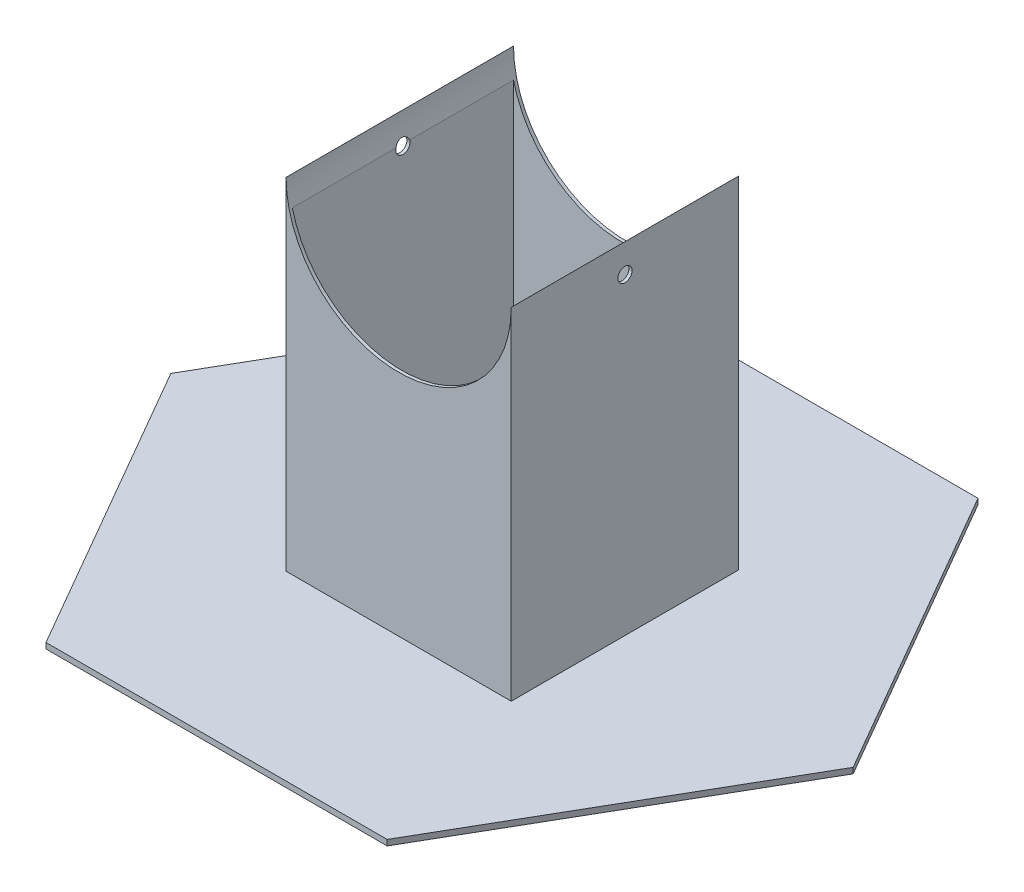
ISO-10303-21;
HEADER;
FILE_DESCRIPTION(('STEP AP214'),'2;1');
FILE_NAME('part.step','',(''),(''),'','','');
FILE_SCHEMA(('AUTOMOTIVE_DESIGN { 1 0 10303 214 1 1 1 1 }'));
ENDSEC;
DATA;
#1=APPLICATION_CONTEXT('core data for automotive mechanical design processes');
#2=APPLICATION_PROTOCOL_DEFINITION('international standard','automotive_design',2000,#1);
#3=PRODUCT_CONTEXT('',#1,'mechanical');
#4=PRODUCT('Part','Part','',(#3));
#5=PRODUCT_RELATED_PRODUCT_CATEGORY('part','',(#4));
#6=PRODUCT_DEFINITION_FORMATION('','',#4);
#7=PRODUCT_DEFINITION_CONTEXT('part definition',#1,'design');
#8=PRODUCT_DEFINITION('design','',#6,#7);
#9=PRODUCT_DEFINITION_SHAPE('','',#8);
#10=(LENGTH_UNIT() NAMED_UNIT(*) SI_UNIT(.MILLI.,.METRE.));
#11=(NAMED_UNIT(*) PLANE_ANGLE_UNIT() SI_UNIT($,.RADIAN.));
#12=(NAMED_UNIT(*) SI_UNIT($,.STERADIAN.) SOLID_ANGLE_UNIT());
#13=UNCERTAINTY_MEASURE_WITH_UNIT(LENGTH_MEASURE(1.E-05),#10,'distance_accuracy_value','');
#14=(GEOMETRIC_REPRESENTATION_CONTEXT(3) GLOBAL_UNCERTAINTY_ASSIGNED_CONTEXT((#13)) GLOBAL_UNIT_ASSIGNED_CONTEXT((#10,
#11,#12)) REPRESENTATION_CONTEXT('',''));
#15=CARTESIAN_POINT('',(0.,0.,0.));
#16=DIRECTION('',(0.,0.,1.));
#17=DIRECTION('',(1.,0.,0.));
#18=AXIS2_PLACEMENT_3D('',#15,#16,#17);
#19=CARTESIAN_POINT('',(-50.292,154.94,-50.8));
#20=DIRECTION('',(0.,0.,1.));
#21=DIRECTION('',(1.,0.,0.));
#22=AXIS2_PLACEMENT_3D('',#19,#20,#21);
#23=PLANE('',#22);
#24=CARTESIAN_POINT('',(0.,154.94,-50.8));
#25=DIRECTION('',(0.,0.,1.));
#26=DIRECTION('',(1.,0.,0.));
#27=AXIS2_PLACEMENT_3D('',#24,#25,#26);
#28=CIRCLE('',#27,50.292);
#29=CARTESIAN_POINT('',(50.292,154.94,-50.8));
#30=VERTEX_POINT('',#29);
#31=CARTESIAN_POINT('',(-50.292,154.94,-50.8));
#32=VERTEX_POINT('',#31);
#33=EDGE_CURVE('E170',#30,#32,#28,.F.);
#34=ORIENTED_EDGE('',*,*,#33,.F.);
#35=DIRECTION('',(0.,-1.,0.));
#36=VECTOR('',#35,1.);
#37=CARTESIAN_POINT('',(50.292,154.94,-50.8));
#38=LINE('',#37,#36);
#39=CARTESIAN_POINT('',(50.292,2.54,-50.8));
#40=VERTEX_POINT('',#39);
#41=EDGE_CURVE('E156',#30,#40,#38,.T.);
#42=ORIENTED_EDGE('',*,*,#41,.T.);
#43=DIRECTION('',(-1.,0.,0.));
#44=VECTOR('',#43,1.);
#45=CARTESIAN_POINT('',(-50.292,2.54,-50.8));
#46=LINE('',#45,#44);
#47=CARTESIAN_POINT('',(-50.292,2.54,-50.8));
#48=VERTEX_POINT('',#47);
#49=EDGE_CURVE('E192',#40,#48,#46,.T.);
#50=ORIENTED_EDGE('',*,*,#49,.T.);
#51=DIRECTION('',(0.,-1.,0.));
#52=VECTOR('',#51,1.);
#53=CARTESIAN_POINT('',(-50.292,154.94,-50.8));
#54=LINE('',#53,#52);
#55=EDGE_CURVE('E167',#32,#48,#54,.T.);
#56=ORIENTED_EDGE('',*,*,#55,.F.);
#57=EDGE_LOOP('',(#34,#42,#50,#56));
#58=FACE_BOUND('',#57,.T.);
#59=ADVANCED_FACE('F33',(#58),#23,.F.);
#60=CARTESIAN_POINT('',(-50.292,154.94,50.8));
#61=DIRECTION('',(0.,0.,-1.));
#62=DIRECTION('',(-1.,0.,0.));
#63=AXIS2_PLACEMENT_3D('',#60,#61,#62);
#64=PLANE('',#63);
#65=CARTESIAN_POINT('',(0.,154.94,50.8));
#66=DIRECTION('',(0.,0.,-1.));
#67=DIRECTION('',(-1.,0.,0.));
#68=AXIS2_PLACEMENT_3D('',#65,#66,#67);
#69=CIRCLE('',#68,50.292);
#70=CARTESIAN_POINT('',(-50.292,154.94,50.8));
#71=VERTEX_POINT('',#70);
#72=CARTESIAN_POINT('',(50.292,154.94,50.8));
#73=VERTEX_POINT('',#72);
#74=EDGE_CURVE('E176',#71,#73,#69,.F.);
#75=ORIENTED_EDGE('',*,*,#74,.F.);
#76=DIRECTION('',(0.,-1.,0.));
#77=VECTOR('',#76,1.);
#78=CARTESIAN_POINT('',(-50.292,154.94,50.8));
#79=LINE('',#78,#77);
#80=CARTESIAN_POINT('',(-50.292,2.54,50.8));
#81=VERTEX_POINT('',#80);
#82=EDGE_CURVE('E197',#71,#81,#79,.T.);
#83=ORIENTED_EDGE('',*,*,#82,.T.);
#84=DIRECTION('',(1.,0.,0.));
#85=VECTOR('',#84,1.);
#86=CARTESIAN_POINT('',(-50.292,2.54,50.8));
#87=LINE('',#86,#85);
#88=CARTESIAN_POINT('',(50.292,2.54,50.8));
#89=VERTEX_POINT('',#88);
#90=EDGE_CURVE('E180',#81,#89,#87,.T.);
#91=ORIENTED_EDGE('',*,*,#90,.T.);
#92=DIRECTION('',(0.,-1.,0.));
#93=VECTOR('',#92,1.);
#94=CARTESIAN_POINT('',(50.292,154.94,50.8));
#95=LINE('',#94,#93);
#96=EDGE_CURVE('E182',#73,#89,#95,.T.);
#97=ORIENTED_EDGE('',*,*,#96,.F.);
#98=EDGE_LOOP('',(#75,#83,#91,#97));
#99=FACE_BOUND('',#98,.T.);
#100=ADVANCED_FACE('F316',(#99),#64,.F.);
#101=CARTESIAN_POINT('',(48.89754,-35.56,-49.40554));
#102=DIRECTION('',(1.,0.,0.));
#103=DIRECTION('',(0.,0.,-1.));
#104=AXIS2_PLACEMENT_3D('',#101,#102,#103);
#105=PLANE('',#104);
#106=DIRECTION('',(0.,0.,1.));
#107=VECTOR('',#106,1.);
#108=CARTESIAN_POINT('',(48.8975399999999,143.179224262473,-819.223906750812));
#109=LINE('',#108,#107);
#110=CARTESIAN_POINT('',(48.89754,143.179224262473,-49.40554));
#111=VERTEX_POINT('',#110);
#112=CARTESIAN_POINT('',(48.89754,143.179224262473,-3.03290006178622));
#113=VERTEX_POINT('',#112);
#114=EDGE_CURVE('E296',#111,#113,#109,.T.);
#115=ORIENTED_EDGE('',*,*,#114,.F.);
#116=DIRECTION('',(0.,1.,0.));
#117=VECTOR('',#116,1.);
#118=CARTESIAN_POINT('',(48.89754,-35.56,-49.40554));
#119=LINE('',#118,#117);
#120=CARTESIAN_POINT('',(48.89754,0.,-49.40554));
#121=VERTEX_POINT('',#120);
#122=EDGE_CURVE('E256',#121,#111,#119,.T.);
#123=ORIENTED_EDGE('',*,*,#122,.F.);
#124=DIRECTION('',(0.,0.,-1.));
#125=VECTOR('',#124,1.);
#126=CARTESIAN_POINT('',(48.89754,0.,0.));
#127=LINE('',#126,#125);
#128=CARTESIAN_POINT('',(48.89754,0.,49.40554));
#129=VERTEX_POINT('',#128);
#130=EDGE_CURVE('E188',#129,#121,#127,.T.);
#131=ORIENTED_EDGE('',*,*,#130,.F.);
#132=DIRECTION('',(0.,1.,0.));
#133=VECTOR('',#132,1.);
#134=CARTESIAN_POINT('',(48.89754,-35.56,49.40554));
#135=LINE('',#134,#133);
#136=CARTESIAN_POINT('',(48.89754,143.179224262473,49.40554));
#137=VERTEX_POINT('',#136);
#138=EDGE_CURVE('E257',#129,#137,#135,.T.);
#139=ORIENTED_EDGE('',*,*,#138,.T.);
#140=CARTESIAN_POINT('',(48.89754,143.179224262472,3.03290006178626));
#141=VERTEX_POINT('',#140);
#142=EDGE_CURVE('E382',#141,#137,#109,.T.);
#143=ORIENTED_EDGE('',*,*,#142,.F.);
#144=CARTESIAN_POINT('',(48.89754,142.24,0.));
#145=DIRECTION('',(1.,0.,0.));
#146=DIRECTION('',(0.,0.,-1.));
#147=AXIS2_PLACEMENT_3D('',#144,#145,#146);
#148=CIRCLE('',#147,3.175);
#149=EDGE_CURVE('E243',#141,#113,#148,.T.);
#150=ORIENTED_EDGE('',*,*,#149,.T.);
#151=EDGE_LOOP('',(#115,#123,#131,#139,#143,#150));
#152=FACE_BOUND('',#151,.T.);
#153=ADVANCED_FACE('F279',(#152),#105,.F.);
#154=CARTESIAN_POINT('',(-48.89754,-35.56,49.40554));
#155=DIRECTION('',(0.,0.,1.));
#156=DIRECTION('',(1.,0.,0.));
#157=AXIS2_PLACEMENT_3D('',#154,#155,#156);
#158=PLANE('',#157);
#159=CARTESIAN_POINT('',(0.,154.94,49.40554));
#160=DIRECTION('',(0.,0.,1.));
#161=DIRECTION('',(1.,0.,0.));
#162=AXIS2_PLACEMENT_3D('',#159,#160,#161);
#163=CIRCLE('',#162,50.292);
#164=CARTESIAN_POINT('',(-48.89754,143.179224262474,49.40554));
#165=VERTEX_POINT('',#164);
#166=EDGE_CURVE('E54',#137,#165,#163,.F.);
#167=ORIENTED_EDGE('',*,*,#166,.F.);
#168=ORIENTED_EDGE('',*,*,#138,.F.);
#169=DIRECTION('',(1.,0.,0.));
#170=VECTOR('',#169,1.);
#171=CARTESIAN_POINT('',(0.,0.,49.40554));
#172=LINE('',#171,#170);
#173=CARTESIAN_POINT('',(-48.89754,0.,49.40554));
#174=VERTEX_POINT('',#173);
#175=EDGE_CURVE('E271',#174,#129,#172,.T.);
#176=ORIENTED_EDGE('',*,*,#175,.F.);
#177=DIRECTION('',(0.,1.,0.));
#178=VECTOR('',#177,1.);
#179=CARTESIAN_POINT('',(-48.89754,-35.56,49.40554));
#180=LINE('',#179,#178);
#181=EDGE_CURVE('E260',#174,#165,#180,.T.);
#182=ORIENTED_EDGE('',*,*,#181,.T.);
#183=EDGE_LOOP('',(#167,#168,#176,#182));
#184=FACE_BOUND('',#183,.T.);
#185=ADVANCED_FACE('F282',(#184),#158,.F.);
#186=CARTESIAN_POINT('',(-48.89754,-35.56,-49.40554));
#187=DIRECTION('',(-1.,0.,0.));
#188=DIRECTION('',(0.,0.,1.));
#189=AXIS2_PLACEMENT_3D('',#186,#187,#188);
#190=PLANE('',#189);
#191=DIRECTION('',(0.,0.,1.));
#192=VECTOR('',#191,1.);
#193=CARTESIAN_POINT('',(-48.8975400000001,143.179224262474,-819.223906750812));
#194=LINE('',#193,#192);
#195=CARTESIAN_POINT('',(-48.89754,143.179224262474,3.0329000617859));
#196=VERTEX_POINT('',#195);
#197=EDGE_CURVE('E62',#165,#196,#194,.F.);
#198=ORIENTED_EDGE('',*,*,#197,.F.);
#199=ORIENTED_EDGE('',*,*,#181,.F.);
#200=DIRECTION('',(0.,0.,1.));
#201=VECTOR('',#200,1.);
#202=CARTESIAN_POINT('',(-48.89754,0.,0.));
#203=LINE('',#202,#201);
#204=CARTESIAN_POINT('',(-48.89754,0.,-49.40554));
#205=VERTEX_POINT('',#204);
#206=EDGE_CURVE('E269',#205,#174,#203,.T.);
#207=ORIENTED_EDGE('',*,*,#206,.F.);
#208=DIRECTION('',(0.,1.,0.));
#209=VECTOR('',#208,1.);
#210=CARTESIAN_POINT('',(-48.89754,-35.56,-49.40554));
#211=LINE('',#210,#209);
#212=CARTESIAN_POINT('',(-48.89754,143.179224262473,-49.40554));
#213=VERTEX_POINT('',#212);
#214=EDGE_CURVE('E262',#205,#213,#211,.T.);
#215=ORIENTED_EDGE('',*,*,#214,.T.);
#216=CARTESIAN_POINT('',(-48.89754,143.179224262474,-3.03290006178589));
#217=VERTEX_POINT('',#216);
#218=EDGE_CURVE('E286',#217,#213,#194,.F.);
#219=ORIENTED_EDGE('',*,*,#218,.F.);
#220=CARTESIAN_POINT('',(-48.89754,142.24,0.));
#221=DIRECTION('',(-1.,0.,0.));
#222=DIRECTION('',(0.,0.,1.));
#223=AXIS2_PLACEMENT_3D('',#220,#221,#222);
#224=CIRCLE('',#223,3.175);
#225=EDGE_CURVE('E242',#217,#196,#224,.T.);
#226=ORIENTED_EDGE('',*,*,#225,.T.);
#227=EDGE_LOOP('',(#198,#199,#207,#215,#219,#226));
#228=FACE_BOUND('',#227,.T.);
#229=ADVANCED_FACE('F284',(#228),#190,.F.);
#230=CARTESIAN_POINT('',(-48.89754,-35.56,-49.40554));
#231=DIRECTION('',(0.,0.,-1.));
#232=DIRECTION('',(-1.,0.,0.));
#233=AXIS2_PLACEMENT_3D('',#230,#231,#232);
#234=PLANE('',#233);
#235=CARTESIAN_POINT('',(0.,154.94,-49.40554));
#236=DIRECTION('',(0.,0.,-1.));
#237=DIRECTION('',(-1.,0.,0.));
#238=AXIS2_PLACEMENT_3D('',#235,#236,#237);
#239=CIRCLE('',#238,50.292);
#240=EDGE_CURVE('E292',#213,#111,#239,.F.);
#241=ORIENTED_EDGE('',*,*,#240,.F.);
#242=ORIENTED_EDGE('',*,*,#214,.F.);
#243=DIRECTION('',(-1.,0.,0.));
#244=VECTOR('',#243,1.);
#245=CARTESIAN_POINT('',(0.,0.,-49.40554));
#246=LINE('',#245,#244);
#247=EDGE_CURVE('E259',#121,#205,#246,.T.);
#248=ORIENTED_EDGE('',*,*,#247,.F.);
#249=ORIENTED_EDGE('',*,*,#122,.T.);
#250=EDGE_LOOP('',(#241,#242,#248,#249));
#251=FACE_BOUND('',#250,.T.);
#252=ADVANCED_FACE('F379',(#251),#234,.F.);
#253=CARTESIAN_POINT('',(-152.564506729179,142.24,0.));
#254=DIRECTION('',(1.,0.,0.));
#255=DIRECTION('',(0.,0.,-1.));
#256=AXIS2_PLACEMENT_3D('',#253,#254,#255);
#257=CYLINDRICAL_SURFACE('',#256,3.175);
#258=CARTESIAN_POINT('',(-50.292,142.24,0.));
#259=DIRECTION('',(1.,0.,0.));
#260=DIRECTION('',(0.,0.,-1.));
#261=AXIS2_PLACEMENT_3D('',#258,#259,#260);
#262=CIRCLE('',#261,3.175);
#263=CARTESIAN_POINT('',(-50.292,142.24,-3.17499999999999));
#264=VERTEX_POINT('',#263);
#265=EDGE_CURVE('E246',#264,#264,#262,.T.);
#266=ORIENTED_EDGE('',*,*,#265,.F.);
#267=EDGE_LOOP('',(#266));
#268=FACE_BOUND('',#267,.T.);
#269=CARTESIAN_POINT('',(-48.89754,143.179224262474,3.03290006178584));
#270=CARTESIAN_POINT('',(-48.9179893992919,143.264238182814,3.0065815960853));
#271=CARTESIAN_POINT('',(-48.9379584637581,143.348246330188,2.9766403521669));
#272=CARTESIAN_POINT('',(-48.9768439050836,143.513662240138,2.90970074910981));
#273=CARTESIAN_POINT('',(-48.9957601920708,143.595069780457,2.87270178866806));
#274=CARTESIAN_POINT('',(-49.032448705651,143.754699055396,2.79183056879005));
#275=CARTESIAN_POINT('',(-49.0502206715994,143.832920062732,2.74795675121051));
#276=CARTESIAN_POINT('',(-49.0845313527572,143.985540981022,2.65363355703935));
#277=CARTESIAN_POINT('',(-49.1010701273031,144.05994107577,2.60318449714461));
#278=CARTESIAN_POINT('',(-49.1487688204472,144.276716257841,2.44228156961581));
#279=CARTESIAN_POINT('',(-49.178001932995,144.412626060457,2.32229228755659));
#280=CARTESIAN_POINT('',(-49.2308129604337,144.662417626851,2.06040933073773));
#281=CARTESIAN_POINT('',(-49.2543939929555,144.776311527639,1.91852780284665));
#282=CARTESIAN_POINT('',(-49.2953215101621,144.976725640279,1.61949285058442));
#283=CARTESIAN_POINT('',(-49.3127718774093,145.063698655853,1.46265764861859));
#284=CARTESIAN_POINT('',(-49.3418817835325,145.210170490173,1.13610750424401));
#285=CARTESIAN_POINT('',(-49.3535404915441,145.269665366853,0.966390717882516));
#286=CARTESIAN_POINT('',(-49.3708615193963,145.358490470322,0.621906555241024));
#287=CARTESIAN_POINT('',(-49.3766183634835,145.38829597427,0.447266370948575));
#288=CARTESIAN_POINT('',(-49.3824469421016,145.418474723158,0.0953868734003471));
#289=CARTESIAN_POINT('',(-49.3825194876369,145.418852166733,-0.0818520654703455));
#290=CARTESIAN_POINT('',(-49.3770001443873,145.390271130975,-0.432637670156184));
#291=CARTESIAN_POINT('',(-49.3714467867848,145.361512203313,-0.606201251606211));
#292=CARTESIAN_POINT('',(-49.3547528518855,145.275864249661,-0.945963435641689));
#293=CARTESIAN_POINT('',(-49.3436121310815,145.218974501151,-1.11216184893894));
#294=CARTESIAN_POINT('',(-49.3157743873761,145.07872461969,-1.43280908044553));
#295=CARTESIAN_POINT('',(-49.2990681335541,144.995320520966,-1.5872378512946));
#296=CARTESIAN_POINT('',(-49.2602195496805,144.80464294086,-1.87981980105898));
#297=CARTESIAN_POINT('',(-49.2380768438732,144.697367809612,-2.01797185398607));
#298=CARTESIAN_POINT('',(-49.1883126621696,144.46097912215,-2.27569483454521));
#299=CARTESIAN_POINT('',(-49.1606358153229,144.331646975927,-2.39505420679704));
#300=CARTESIAN_POINT('',(-49.1003044498272,144.055827010561,-2.61035757164311));
#301=CARTESIAN_POINT('',(-49.0676519130346,143.909346027294,-2.70631084766806));
#302=CARTESIAN_POINT('',(-49.0117483963388,143.6642398046,-2.83958274073972));
#303=CARTESIAN_POINT('',(-48.9898957075442,143.569637844502,-2.88507275872232));
#304=CARTESIAN_POINT('',(-48.9447625290135,143.376898135769,-2.9663117179059));
#305=CARTESIAN_POINT('',(-48.9214849727467,143.278767812468,-3.00207989908564));
#306=CARTESIAN_POINT('',(-48.8975400000002,143.179224262474,-3.03290006178582));
#307=B_SPLINE_CURVE_WITH_KNOTS('',3,(#269,#270,#271,#272,#273,#274,#275,#276,#277,#278,#279,
#280,#281,#282,#283,#284,#285,#286,#287,#288,#289,#290,#291,#292,#293,#294,#295,#296,#297,#298,
#299,#300,#301,#302,#303,#304,#305,#306),.UNSPECIFIED.,.F.,.F.,(4,2,2,2,2,2,2,2,2,2,2,2,2,2,2,2,
2,2,4),(0.,0.273862412887594,0.547748168724408,0.821696089075695,1.09563081958494,
1.64363640597205,2.19133901873811,2.72925403482774,3.26724619727868,3.79648051276399,
4.32563931987136,4.85119831631432,5.37677081204049,5.90321939176572,6.42970436871027,
6.96174738289733,7.49357903143091,7.81477732175509,8.13533523872828),.UNSPECIFIED.);
#308=EDGE_CURVE('E293',#196,#217,#307,.T.);
#309=ORIENTED_EDGE('',*,*,#308,.F.);
#310=ORIENTED_EDGE('',*,*,#225,.F.);
#311=EDGE_LOOP('',(#309,#310));
#312=FACE_BOUND('',#311,.T.);
#313=ADVANCED_FACE('F303',(#268,#312),#257,.F.);
#314=CARTESIAN_POINT('',(50.292,142.24,0.));
#315=DIRECTION('',(1.,0.,0.));
#316=DIRECTION('',(0.,0.,-1.));
#317=AXIS2_PLACEMENT_3D('',#314,#315,#316);
#318=CIRCLE('',#317,3.175);
#319=CARTESIAN_POINT('',(50.292,142.24,-3.17500000000001));
#320=VERTEX_POINT('',#319);
#321=EDGE_CURVE('E175',#320,#320,#318,.T.);
#322=ORIENTED_EDGE('',*,*,#321,.T.);
#323=EDGE_LOOP('',(#322));
#324=FACE_BOUND('',#323,.T.);
#325=CARTESIAN_POINT('',(48.89754,143.179224262472,-3.03290006178628));
#326=CARTESIAN_POINT('',(48.9179893992916,143.264238182812,-3.00658159608577));
#327=CARTESIAN_POINT('',(48.9379584637578,143.348246330187,-2.9766403521674));
#328=CARTESIAN_POINT('',(48.9768439050832,143.513662240137,-2.90970074911038));
#329=CARTESIAN_POINT('',(48.9957601920704,143.595069780456,-2.87270178866867));
#330=CARTESIAN_POINT('',(49.0324487056507,143.754699055395,-2.79183056879074));
#331=CARTESIAN_POINT('',(49.0502206715991,143.832920062731,-2.74795675121123));
#332=CARTESIAN_POINT('',(49.0845313527569,143.985540981021,-2.65363355704014));
#333=CARTESIAN_POINT('',(49.1010701273028,144.059941075768,-2.60318449714544));
#334=CARTESIAN_POINT('',(49.148768820447,144.27671625784,-2.44228156961675));
#335=CARTESIAN_POINT('',(49.1780019329947,144.412626060456,-2.3222922875576));
#336=CARTESIAN_POINT('',(49.2308129604335,144.66241762685,-2.06040933073886));
#337=CARTESIAN_POINT('',(49.2543939929553,144.776311527638,-1.91852780284784));
#338=CARTESIAN_POINT('',(49.2953215101619,144.976725640278,-1.6194928505857));
#339=CARTESIAN_POINT('',(49.3127718774092,145.063698655852,-1.46265764861991));
#340=CARTESIAN_POINT('',(49.3418817835324,145.210170490172,-1.13610750424538));
#341=CARTESIAN_POINT('',(49.353540491544,145.269665366853,-0.966390717883905));
#342=CARTESIAN_POINT('',(49.3708615193962,145.358490470322,-0.621906555242443));
#343=CARTESIAN_POINT('',(49.3766183634834,145.38829597427,-0.44726637095001));
#344=CARTESIAN_POINT('',(49.3824469421016,145.418474723158,-0.0953868734017954));
#345=CARTESIAN_POINT('',(49.3825194876369,145.418852166733,0.0818520654688988));
#346=CARTESIAN_POINT('',(49.3770001443873,145.390271130975,0.432637670154756));
#347=CARTESIAN_POINT('',(49.3714467867848,145.361512203314,0.6062012516048));
#348=CARTESIAN_POINT('',(49.3547528518856,145.275864249662,0.945963435640323));
#349=CARTESIAN_POINT('',(49.3436121310816,145.218974501152,1.1121618489376));
#350=CARTESIAN_POINT('',(49.3157743873762,145.078724619691,1.43280908044426));
#351=CARTESIAN_POINT('',(49.2990681335542,144.995320520967,1.58723785129336));
#352=CARTESIAN_POINT('',(49.2602195496806,144.804642940861,1.87981980105782));
#353=CARTESIAN_POINT('',(49.2380768438734,144.697367809613,2.01797185398497));
#354=CARTESIAN_POINT('',(49.1883126621698,144.460979122151,2.2756948345442));
#355=CARTESIAN_POINT('',(49.1606358153231,144.331646975928,2.39505420679608));
#356=CARTESIAN_POINT('',(49.1003044498274,144.055827010562,2.61035757164226));
#357=CARTESIAN_POINT('',(49.0676519130349,143.909346027295,2.70631084766729));
#358=CARTESIAN_POINT('',(49.011748396339,143.664239804601,2.8395827407393));
#359=CARTESIAN_POINT('',(48.9898957075442,143.569637844503,2.88507275872214));
#360=CARTESIAN_POINT('',(48.9447625290134,143.376898135769,2.96631171790609));
#361=CARTESIAN_POINT('',(48.9214849727464,143.278767812467,3.00207989908597));
#362=CARTESIAN_POINT('',(48.8975399999998,143.179224262472,3.03290006178625));
#363=B_SPLINE_CURVE_WITH_KNOTS('',3,(#325,#326,#327,#328,#329,#330,#331,#332,#333,#334,#335,
#336,#337,#338,#339,#340,#341,#342,#343,#344,#345,#346,#347,#348,#349,#350,#351,#352,#353,#354,
#355,#356,#357,#358,#359,#360,#361,#362),.UNSPECIFIED.,.F.,.F.,(4,2,2,2,2,2,2,2,2,2,2,2,2,2,2,2,
2,2,4),(0.,0.273862412887628,0.547748168724424,0.82169608907571,1.09563081958495,
1.64363640597202,2.19133901873808,2.72925403482773,3.26724619727871,3.79648051276402,
4.3256393198714,4.85119831631436,5.37677081204053,5.90321939176577,6.42970436871031,
6.96174738289734,7.49357903143091,7.81477732175656,8.13533523873125),.UNSPECIFIED.);
#364=EDGE_CURVE('E11',#113,#141,#363,.T.);
#365=ORIENTED_EDGE('',*,*,#364,.F.);
#366=ORIENTED_EDGE('',*,*,#149,.F.);
#367=EDGE_LOOP('',(#365,#366));
#368=FACE_BOUND('',#367,.T.);
#369=ADVANCED_FACE('F354',(#324,#368),#257,.F.);
#370=CARTESIAN_POINT('',(-76.3645067291794,2.54,131.982271536748));
#371=DIRECTION('',(0.,0.,-1.));
#372=DIRECTION('',(-1.,0.,0.));
#373=AXIS2_PLACEMENT_3D('',#370,#371,#372);
#374=PLANE('',#373);
#375=DIRECTION('',(1.,0.,0.));
#376=VECTOR('',#375,1.);
#377=CARTESIAN_POINT('',(-76.3645067291794,0.,131.982271536748));
#378=LINE('',#377,#376);
#379=CARTESIAN_POINT('',(-76.3645067291794,0.,131.982271536748));
#380=VERTEX_POINT('',#379);
#381=CARTESIAN_POINT('',(76.0354932708207,0.,131.982271536748));
#382=VERTEX_POINT('',#381);
#383=EDGE_CURVE('E166',#380,#382,#378,.T.);
#384=ORIENTED_EDGE('',*,*,#383,.T.);
#385=DIRECTION('',(0.,-1.,0.));
#386=VECTOR('',#385,1.);
#387=CARTESIAN_POINT('',(76.0354932708207,2.54,131.982271536748));
#388=LINE('',#387,#386);
#389=CARTESIAN_POINT('',(76.0354932708207,2.54,131.982271536748));
#390=VERTEX_POINT('',#389);
#391=EDGE_CURVE('E47',#390,#382,#388,.T.);
#392=ORIENTED_EDGE('',*,*,#391,.F.);
#393=DIRECTION('',(1.,0.,0.));
#394=VECTOR('',#393,1.);
#395=CARTESIAN_POINT('',(-76.3645067291794,2.54,131.982271536748));
#396=LINE('',#395,#394);
#397=CARTESIAN_POINT('',(-76.3645067291794,2.54,131.982271536748));
#398=VERTEX_POINT('',#397);
#399=EDGE_CURVE('E201',#398,#390,#396,.T.);
#400=ORIENTED_EDGE('',*,*,#399,.F.);
#401=DIRECTION('',(0.,-1.,0.));
#402=VECTOR('',#401,1.);
#403=CARTESIAN_POINT('',(-76.3645067291794,2.54,131.982271536748));
#404=LINE('',#403,#402);
#405=EDGE_CURVE('E215',#398,#380,#404,.T.);
#406=ORIENTED_EDGE('',*,*,#405,.T.);
#407=EDGE_LOOP('',(#384,#392,#400,#406));
#408=FACE_BOUND('',#407,.T.);
#409=ADVANCED_FACE('F35',(#408),#374,.F.);
#410=CARTESIAN_POINT('',(76.0354932708207,2.54,131.982271536748));
#411=DIRECTION('',(-0.866025403784439,0.,-0.5));
#412=DIRECTION('',(-0.5,0.,0.866025403784439));
#413=AXIS2_PLACEMENT_3D('',#410,#411,#412);
#414=PLANE('',#413);
#415=DIRECTION('',(0.5,0.,-0.866025403784439));
#416=VECTOR('',#415,1.);
#417=CARTESIAN_POINT('',(76.0354932708207,0.,131.982271536748));
#418=LINE('',#417,#416);
#419=CARTESIAN_POINT('',(152.235493270821,0.,0.));
#420=VERTEX_POINT('',#419);
#421=EDGE_CURVE('E218',#382,#420,#418,.T.);
#422=ORIENTED_EDGE('',*,*,#421,.T.);
#423=DIRECTION('',(0.,-1.,0.));
#424=VECTOR('',#423,1.);
#425=CARTESIAN_POINT('',(152.235493270821,2.54,0.));
#426=LINE('',#425,#424);
#427=CARTESIAN_POINT('',(152.235493270821,2.54,0.));
#428=VERTEX_POINT('',#427);
#429=EDGE_CURVE('E238',#428,#420,#426,.T.);
#430=ORIENTED_EDGE('',*,*,#429,.F.);
#431=DIRECTION('',(0.5,0.,-0.866025403784439));
#432=VECTOR('',#431,1.);
#433=CARTESIAN_POINT('',(76.0354932708207,2.54,131.982271536748));
#434=LINE('',#433,#432);
#435=EDGE_CURVE('E204',#390,#428,#434,.T.);
#436=ORIENTED_EDGE('',*,*,#435,.F.);
#437=ORIENTED_EDGE('',*,*,#391,.T.);
#438=EDGE_LOOP('',(#422,#430,#436,#437));
#439=FACE_BOUND('',#438,.T.);
#440=ADVANCED_FACE('F347',(#439),#414,.F.);
#441=CARTESIAN_POINT('',(152.235493270821,2.54,0.));
#442=DIRECTION('',(-0.866025403784439,0.,0.5));
#443=DIRECTION('',(0.5,0.,0.866025403784439));
#444=AXIS2_PLACEMENT_3D('',#441,#442,#443);
#445=PLANE('',#444);
#446=DIRECTION('',(-0.5,0.,-0.866025403784439));
#447=VECTOR('',#446,1.);
#448=CARTESIAN_POINT('',(152.235493270821,0.,0.));
#449=LINE('',#448,#447);
#450=CARTESIAN_POINT('',(76.0354932708207,0.,-131.982271536748));
#451=VERTEX_POINT('',#450);
#452=EDGE_CURVE('E220',#420,#451,#449,.T.);
#453=ORIENTED_EDGE('',*,*,#452,.T.);
#454=DIRECTION('',(0.,-1.,0.));
#455=VECTOR('',#454,1.);
#456=CARTESIAN_POINT('',(76.0354932708207,2.54,-131.982271536748));
#457=LINE('',#456,#455);
#458=CARTESIAN_POINT('',(76.0354932708207,2.54,-131.982271536748));
#459=VERTEX_POINT('',#458);
#460=EDGE_CURVE('E235',#459,#451,#457,.T.);
#461=ORIENTED_EDGE('',*,*,#460,.F.);
#462=DIRECTION('',(-0.5,0.,-0.866025403784439));
#463=VECTOR('',#462,1.);
#464=CARTESIAN_POINT('',(152.235493270821,2.54,0.));
#465=LINE('',#464,#463);
#466=EDGE_CURVE('E207',#428,#459,#465,.T.);
#467=ORIENTED_EDGE('',*,*,#466,.F.);
#468=ORIENTED_EDGE('',*,*,#429,.T.);
#469=EDGE_LOOP('',(#453,#461,#467,#468));
#470=FACE_BOUND('',#469,.T.);
#471=ADVANCED_FACE('F344',(#470),#445,.F.);
#472=CARTESIAN_POINT('',(76.0354932708207,2.54,-131.982271536748));
#473=DIRECTION('',(0.,0.,1.));
#474=DIRECTION('',(1.,0.,0.));
#475=AXIS2_PLACEMENT_3D('',#472,#473,#474);
#476=PLANE('',#475);
#477=DIRECTION('',(-1.,0.,0.));
#478=VECTOR('',#477,1.);
#479=CARTESIAN_POINT('',(76.0354932708207,0.,-131.982271536748));
#480=LINE('',#479,#478);
#481=CARTESIAN_POINT('',(-76.3645067291793,0.,-131.982271536748));
#482=VERTEX_POINT('',#481);
#483=EDGE_CURVE('E222',#451,#482,#480,.T.);
#484=ORIENTED_EDGE('',*,*,#483,.T.);
#485=DIRECTION('',(0.,-1.,0.));
#486=VECTOR('',#485,1.);
#487=CARTESIAN_POINT('',(-76.3645067291793,2.54,-131.982271536748));
#488=LINE('',#487,#486);
#489=CARTESIAN_POINT('',(-76.3645067291793,2.54,-131.982271536748));
#490=VERTEX_POINT('',#489);
#491=EDGE_CURVE('E232',#490,#482,#488,.T.);
#492=ORIENTED_EDGE('',*,*,#491,.F.);
#493=DIRECTION('',(-1.,0.,0.));
#494=VECTOR('',#493,1.);
#495=CARTESIAN_POINT('',(76.0354932708207,2.54,-131.982271536748));
#496=LINE('',#495,#494);
#497=EDGE_CURVE('E209',#459,#490,#496,.T.);
#498=ORIENTED_EDGE('',*,*,#497,.F.);
#499=ORIENTED_EDGE('',*,*,#460,.T.);
#500=EDGE_LOOP('',(#484,#492,#498,#499));
#501=FACE_BOUND('',#500,.T.);
#502=ADVANCED_FACE('F340',(#501),#476,.F.);
#503=CARTESIAN_POINT('',(-76.3645067291793,2.54,-131.982271536748));
#504=DIRECTION('',(0.866025403784438,0.,0.5));
#505=DIRECTION('',(0.500000000000001,0.,-0.866025403784438));
#506=AXIS2_PLACEMENT_3D('',#503,#504,#505);
#507=PLANE('',#506);
#508=DIRECTION('',(-0.5,0.,0.866025403784438));
#509=VECTOR('',#508,1.);
#510=CARTESIAN_POINT('',(-76.3645067291793,0.,-131.982271536748));
#511=LINE('',#510,#509);
#512=CARTESIAN_POINT('',(-152.564506729179,0.,0.));
#513=VERTEX_POINT('',#512);
#514=EDGE_CURVE('E224',#482,#513,#511,.T.);
#515=ORIENTED_EDGE('',*,*,#514,.T.);
#516=DIRECTION('',(0.,-1.,0.));
#517=VECTOR('',#516,1.);
#518=CARTESIAN_POINT('',(-152.564506729179,2.54,0.));
#519=LINE('',#518,#517);
#520=CARTESIAN_POINT('',(-152.564506729179,2.54,0.));
#521=VERTEX_POINT('',#520);
#522=EDGE_CURVE('E229',#521,#513,#519,.T.);
#523=ORIENTED_EDGE('',*,*,#522,.F.);
#524=DIRECTION('',(-0.5,0.,0.866025403784438));
#525=VECTOR('',#524,1.);
#526=CARTESIAN_POINT('',(-76.3645067291793,2.54,-131.982271536748));
#527=LINE('',#526,#525);
#528=EDGE_CURVE('E211',#490,#521,#527,.T.);
#529=ORIENTED_EDGE('',*,*,#528,.F.);
#530=ORIENTED_EDGE('',*,*,#491,.T.);
#531=EDGE_LOOP('',(#515,#523,#529,#530));
#532=FACE_BOUND('',#531,.T.);
#533=ADVANCED_FACE('F336',(#532),#507,.F.);
#534=CARTESIAN_POINT('',(-152.564506729179,2.54,0.));
#535=DIRECTION('',(0.866025403784439,0.,-0.5));
#536=DIRECTION('',(-0.5,0.,-0.866025403784439));
#537=AXIS2_PLACEMENT_3D('',#534,#535,#536);
#538=PLANE('',#537);
#539=DIRECTION('',(0.5,0.,0.866025403784439));
#540=VECTOR('',#539,1.);
#541=CARTESIAN_POINT('',(-152.564506729179,0.,0.));
#542=LINE('',#541,#540);
#543=EDGE_CURVE('E205',#513,#380,#542,.T.);
#544=ORIENTED_EDGE('',*,*,#543,.T.);
#545=ORIENTED_EDGE('',*,*,#405,.F.);
#546=DIRECTION('',(0.5,0.,0.866025403784439));
#547=VECTOR('',#546,1.);
#548=CARTESIAN_POINT('',(-152.564506729179,2.54,0.));
#549=LINE('',#548,#547);
#550=EDGE_CURVE('E213',#521,#398,#549,.T.);
#551=ORIENTED_EDGE('',*,*,#550,.F.);
#552=ORIENTED_EDGE('',*,*,#522,.T.);
#553=EDGE_LOOP('',(#544,#545,#551,#552));
#554=FACE_BOUND('',#553,.T.);
#555=ADVANCED_FACE('F330',(#554),#538,.F.);
#556=CARTESIAN_POINT('',(0.,2.54,0.));
#557=DIRECTION('',(0.,1.,0.));
#558=DIRECTION('',(0.,0.,1.));
#559=AXIS2_PLACEMENT_3D('',#556,#557,#558);
#560=PLANE('',#559);
#561=DIRECTION('',(0.,0.,-1.));
#562=VECTOR('',#561,1.);
#563=CARTESIAN_POINT('',(50.292,2.54,-50.8));
#564=LINE('',#563,#562);
#565=EDGE_CURVE('E163',#89,#40,#564,.T.);
#566=ORIENTED_EDGE('',*,*,#565,.F.);
#567=ORIENTED_EDGE('',*,*,#90,.F.);
#568=DIRECTION('',(0.,0.,1.));
#569=VECTOR('',#568,1.);
#570=CARTESIAN_POINT('',(-50.292,2.54,-50.8));
#571=LINE('',#570,#569);
#572=EDGE_CURVE('E185',#48,#81,#571,.T.);
#573=ORIENTED_EDGE('',*,*,#572,.F.);
#574=ORIENTED_EDGE('',*,*,#49,.F.);
#575=EDGE_LOOP('',(#566,#567,#573,#574));
#576=FACE_BOUND('',#575,.T.);
#577=ORIENTED_EDGE('',*,*,#399,.T.);
#578=ORIENTED_EDGE('',*,*,#435,.T.);
#579=ORIENTED_EDGE('',*,*,#466,.T.);
#580=ORIENTED_EDGE('',*,*,#497,.T.);
#581=ORIENTED_EDGE('',*,*,#528,.T.);
#582=ORIENTED_EDGE('',*,*,#550,.T.);
#583=EDGE_LOOP('',(#577,#578,#579,#580,#581,#582));
#584=FACE_BOUND('',#583,.T.);
#585=ADVANCED_FACE('F327',(#576,#584),#560,.T.);
#586=CARTESIAN_POINT('',(0.,0.,0.));
#587=DIRECTION('',(0.,1.,0.));
#588=DIRECTION('',(0.,0.,1.));
#589=AXIS2_PLACEMENT_3D('',#586,#587,#588);
#590=PLANE('',#589);
#591=ORIENTED_EDGE('',*,*,#175,.T.);
#592=ORIENTED_EDGE('',*,*,#130,.T.);
#593=ORIENTED_EDGE('',*,*,#247,.T.);
#594=ORIENTED_EDGE('',*,*,#206,.T.);
#595=EDGE_LOOP('',(#591,#592,#593,#594));
#596=FACE_BOUND('',#595,.T.);
#597=ORIENTED_EDGE('',*,*,#383,.F.);
#598=ORIENTED_EDGE('',*,*,#543,.F.);
#599=ORIENTED_EDGE('',*,*,#514,.F.);
#600=ORIENTED_EDGE('',*,*,#483,.F.);
#601=ORIENTED_EDGE('',*,*,#452,.F.);
#602=ORIENTED_EDGE('',*,*,#421,.F.);
#603=EDGE_LOOP('',(#597,#598,#599,#600,#601,#602));
#604=FACE_BOUND('',#603,.T.);
#605=ADVANCED_FACE('F275',(#596,#604),#590,.F.);
#606=CARTESIAN_POINT('',(50.292,154.94,-50.8));
#607=DIRECTION('',(-1.,0.,0.));
#608=DIRECTION('',(0.,0.,1.));
#609=AXIS2_PLACEMENT_3D('',#606,#607,#608);
#610=PLANE('',#609);
#611=ORIENTED_EDGE('',*,*,#321,.F.);
#612=EDGE_LOOP('',(#611));
#613=FACE_BOUND('',#612,.T.);
#614=ORIENTED_EDGE('',*,*,#565,.T.);
#615=ORIENTED_EDGE('',*,*,#41,.F.);
#616=DIRECTION('',(0.,0.,-1.));
#617=VECTOR('',#616,1.);
#618=CARTESIAN_POINT('',(50.292,154.94,-50.8));
#619=LINE('',#618,#617);
#620=EDGE_CURVE('E161',#73,#30,#619,.T.);
#621=ORIENTED_EDGE('',*,*,#620,.F.);
#622=ORIENTED_EDGE('',*,*,#96,.T.);
#623=EDGE_LOOP('',(#614,#615,#621,#622));
#624=FACE_BOUND('',#623,.T.);
#625=ADVANCED_FACE('F158',(#613,#624),#610,.F.);
#626=CARTESIAN_POINT('',(-50.292,154.94,-50.8));
#627=DIRECTION('',(1.,0.,0.));
#628=DIRECTION('',(0.,0.,-1.));
#629=AXIS2_PLACEMENT_3D('',#626,#627,#628);
#630=PLANE('',#629);
#631=ORIENTED_EDGE('',*,*,#265,.T.);
#632=EDGE_LOOP('',(#631));
#633=FACE_BOUND('',#632,.T.);
#634=ORIENTED_EDGE('',*,*,#572,.T.);
#635=ORIENTED_EDGE('',*,*,#82,.F.);
#636=DIRECTION('',(0.,0.,1.));
#637=VECTOR('',#636,1.);
#638=CARTESIAN_POINT('',(-50.292,154.94,-50.8));
#639=LINE('',#638,#637);
#640=EDGE_CURVE('E179',#32,#71,#639,.T.);
#641=ORIENTED_EDGE('',*,*,#640,.F.);
#642=ORIENTED_EDGE('',*,*,#55,.T.);
#643=EDGE_LOOP('',(#634,#635,#641,#642));
#644=FACE_BOUND('',#643,.T.);
#645=ADVANCED_FACE('F308',(#633,#644),#630,.F.);
#646=CARTESIAN_POINT('',(0.,154.94,-819.223906750812));
#647=DIRECTION('',(0.,0.,1.));
#648=DIRECTION('',(1.,0.,0.));
#649=AXIS2_PLACEMENT_3D('',#646,#647,#648);
#650=CYLINDRICAL_SURFACE('',#649,50.292);
#651=ORIENTED_EDGE('',*,*,#166,.T.);
#652=ORIENTED_EDGE('',*,*,#197,.T.);
#653=ORIENTED_EDGE('',*,*,#308,.T.);
#654=ORIENTED_EDGE('',*,*,#218,.T.);
#655=ORIENTED_EDGE('',*,*,#240,.T.);
#656=ORIENTED_EDGE('',*,*,#114,.T.);
#657=ORIENTED_EDGE('',*,*,#364,.T.);
#658=ORIENTED_EDGE('',*,*,#142,.T.);
#659=EDGE_LOOP('',(#651,#652,#653,#654,#655,#656,#657,#658));
#660=FACE_BOUND('',#659,.T.);
#661=ORIENTED_EDGE('',*,*,#620,.T.);
#662=ORIENTED_EDGE('',*,*,#33,.T.);
#663=ORIENTED_EDGE('',*,*,#640,.T.);
#664=ORIENTED_EDGE('',*,*,#74,.T.);
#665=EDGE_LOOP('',(#661,#662,#663,#664));
#666=FACE_BOUND('',#665,.T.);
#667=ADVANCED_FACE('F178',(#660,#666),#650,.F.);
#668=CLOSED_SHELL('',(#59,#100,#153,#185,#229,#252,#313,#369,#409,#440,#471,#502,#533,#555,#585,
#605,#625,#645,#667));
#669=MANIFOLD_SOLID_BREP('B2',#668);
#670=ADVANCED_BREP_SHAPE_REPRESENTATION('',(#18,#669),#14);
#671=SHAPE_DEFINITION_REPRESENTATION(#9,#670);
ENDSEC;
END-ISO-10303-21;
